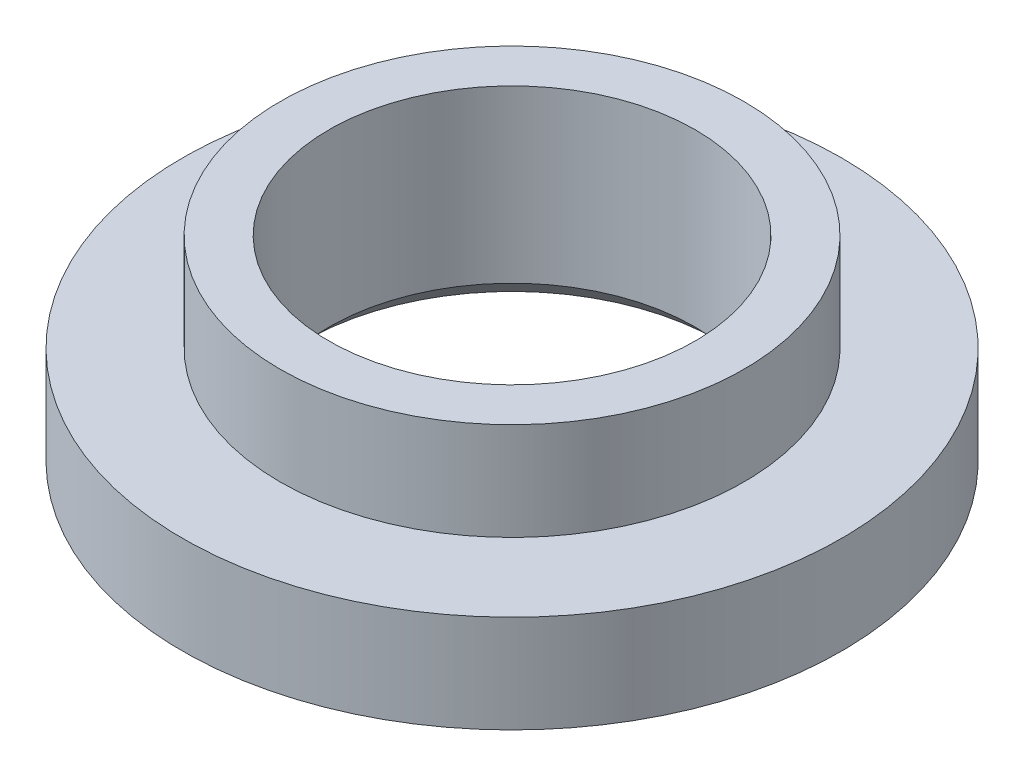
ISO-10303-21;
HEADER;
FILE_DESCRIPTION(('STEP AP214'),'2;1');
FILE_NAME('part.step','',(''),(''),'','','');
FILE_SCHEMA(('AUTOMOTIVE_DESIGN { 1 0 10303 214 1 1 1 1 }'));
ENDSEC;
DATA;
#1=APPLICATION_CONTEXT('core data for automotive mechanical design processes');
#2=APPLICATION_PROTOCOL_DEFINITION('international standard','automotive_design',2000,#1);
#3=PRODUCT_CONTEXT('',#1,'mechanical');
#4=PRODUCT('Part','Part','',(#3));
#5=PRODUCT_RELATED_PRODUCT_CATEGORY('part','',(#4));
#6=PRODUCT_DEFINITION_FORMATION('','',#4);
#7=PRODUCT_DEFINITION_CONTEXT('part definition',#1,'design');
#8=PRODUCT_DEFINITION('design','',#6,#7);
#9=PRODUCT_DEFINITION_SHAPE('','',#8);
#10=(LENGTH_UNIT() NAMED_UNIT(*) SI_UNIT(.MILLI.,.METRE.));
#11=(NAMED_UNIT(*) PLANE_ANGLE_UNIT() SI_UNIT($,.RADIAN.));
#12=(NAMED_UNIT(*) SI_UNIT($,.STERADIAN.) SOLID_ANGLE_UNIT());
#13=UNCERTAINTY_MEASURE_WITH_UNIT(LENGTH_MEASURE(1.E-05),#10,'distance_accuracy_value','');
#14=(GEOMETRIC_REPRESENTATION_CONTEXT(3) GLOBAL_UNCERTAINTY_ASSIGNED_CONTEXT((#13)) GLOBAL_UNIT_ASSIGNED_CONTEXT((#10,
#11,#12)) REPRESENTATION_CONTEXT('',''));
#15=CARTESIAN_POINT('',(0.,0.,0.));
#16=DIRECTION('',(0.,0.,1.));
#17=DIRECTION('',(1.,0.,0.));
#18=AXIS2_PLACEMENT_3D('',#15,#16,#17);
#19=CARTESIAN_POINT('',(0.,0.,0.));
#20=DIRECTION('',(0.,-1.,0.));
#21=DIRECTION('',(0.,0.,-1.));
#22=AXIS2_PLACEMENT_3D('',#19,#20,#21);
#23=CYLINDRICAL_SURFACE('',#22,1.5);
#24=CARTESIAN_POINT('',(0.,0.200000000000001,0.));
#25=DIRECTION('',(0.,-1.,0.));
#26=DIRECTION('',(0.,0.,-1.));
#27=AXIS2_PLACEMENT_3D('',#24,#25,#26);
#28=CIRCLE('',#27,1.5);
#29=CARTESIAN_POINT('',(0.,0.200000000000001,-1.5));
#30=VERTEX_POINT('',#29);
#31=EDGE_CURVE('E53',#30,#30,#28,.T.);
#32=ORIENTED_EDGE('',*,*,#31,.T.);
#33=EDGE_LOOP('',(#32));
#34=FACE_BOUND('',#33,.T.);
#35=CARTESIAN_POINT('',(0.,1.6,0.));
#36=DIRECTION('',(0.,-1.,0.));
#37=DIRECTION('',(0.,0.,-1.));
#38=AXIS2_PLACEMENT_3D('',#35,#36,#37);
#39=CIRCLE('',#38,1.5);
#40=CARTESIAN_POINT('',(0.,1.6,-1.5));
#41=VERTEX_POINT('',#40);
#42=EDGE_CURVE('E77',#41,#41,#39,.T.);
#43=ORIENTED_EDGE('',*,*,#42,.F.);
#44=EDGE_LOOP('',(#43));
#45=FACE_BOUND('',#44,.T.);
#46=ADVANCED_FACE('F44',(#34,#45),#23,.F.);
#47=CARTESIAN_POINT('',(1.5,0.,0.));
#48=DIRECTION('',(0.,-1.,0.));
#49=DIRECTION('',(0.,0.,-1.));
#50=AXIS2_PLACEMENT_3D('',#47,#48,#49);
#51=PLANE('',#50);
#52=CARTESIAN_POINT('',(0.,0.,0.));
#53=DIRECTION('',(0.,-1.,0.));
#54=DIRECTION('',(0.,0.,-1.));
#55=AXIS2_PLACEMENT_3D('',#52,#53,#54);
#56=CIRCLE('',#55,1.7);
#57=CARTESIAN_POINT('',(0.,0.,-1.7));
#58=VERTEX_POINT('',#57);
#59=EDGE_CURVE('E10',#58,#58,#56,.F.);
#60=ORIENTED_EDGE('',*,*,#59,.T.);
#61=EDGE_LOOP('',(#60));
#62=FACE_BOUND('',#61,.T.);
#63=CARTESIAN_POINT('',(0.,0.,0.));
#64=DIRECTION('',(0.,-1.,0.));
#65=DIRECTION('',(0.,0.,-1.));
#66=AXIS2_PLACEMENT_3D('',#63,#64,#65);
#67=CIRCLE('',#66,2.7);
#68=CARTESIAN_POINT('',(0.,0.,-2.7));
#69=VERTEX_POINT('',#68);
#70=EDGE_CURVE('E58',#69,#69,#67,.T.);
#71=ORIENTED_EDGE('',*,*,#70,.T.);
#72=EDGE_LOOP('',(#71));
#73=FACE_BOUND('',#72,.T.);
#74=ADVANCED_FACE('F86',(#62,#73),#51,.T.);
#75=CARTESIAN_POINT('',(0.,0.,0.));
#76=DIRECTION('',(0.,-1.,0.));
#77=DIRECTION('',(0.,0.,-1.));
#78=AXIS2_PLACEMENT_3D('',#75,#76,#77);
#79=CYLINDRICAL_SURFACE('',#78,2.7);
#80=CARTESIAN_POINT('',(0.,0.8,0.));
#81=DIRECTION('',(0.,-1.,0.));
#82=DIRECTION('',(0.,0.,-1.));
#83=AXIS2_PLACEMENT_3D('',#80,#81,#82);
#84=CIRCLE('',#83,2.7);
#85=CARTESIAN_POINT('',(0.,0.8,-2.7));
#86=VERTEX_POINT('',#85);
#87=EDGE_CURVE('E63',#86,#86,#84,.T.);
#88=ORIENTED_EDGE('',*,*,#87,.T.);
#89=EDGE_LOOP('',(#88));
#90=FACE_BOUND('',#89,.T.);
#91=ORIENTED_EDGE('',*,*,#70,.F.);
#92=EDGE_LOOP('',(#91));
#93=FACE_BOUND('',#92,.T.);
#94=ADVANCED_FACE('F91',(#90,#93),#79,.T.);
#95=CARTESIAN_POINT('',(2.7,0.8,0.));
#96=DIRECTION('',(0.,1.,0.));
#97=DIRECTION('',(0.,0.,1.));
#98=AXIS2_PLACEMENT_3D('',#95,#96,#97);
#99=PLANE('',#98);
#100=CARTESIAN_POINT('',(0.,0.799999999999999,0.));
#101=DIRECTION('',(0.,-1.,0.));
#102=DIRECTION('',(0.,0.,-1.));
#103=AXIS2_PLACEMENT_3D('',#100,#101,#102);
#104=CIRCLE('',#103,1.9);
#105=CARTESIAN_POINT('',(0.,0.799999999999999,-1.9));
#106=VERTEX_POINT('',#105);
#107=EDGE_CURVE('E69',#106,#106,#104,.T.);
#108=ORIENTED_EDGE('',*,*,#107,.T.);
#109=EDGE_LOOP('',(#108));
#110=FACE_BOUND('',#109,.T.);
#111=ORIENTED_EDGE('',*,*,#87,.F.);
#112=EDGE_LOOP('',(#111));
#113=FACE_BOUND('',#112,.T.);
#114=ADVANCED_FACE('F96',(#110,#113),#99,.T.);
#115=CARTESIAN_POINT('',(0.,0.,0.));
#116=DIRECTION('',(0.,-1.,0.));
#117=DIRECTION('',(0.,0.,-1.));
#118=AXIS2_PLACEMENT_3D('',#115,#116,#117);
#119=CYLINDRICAL_SURFACE('',#118,1.9);
#120=CARTESIAN_POINT('',(0.,1.6,0.));
#121=DIRECTION('',(0.,-1.,0.));
#122=DIRECTION('',(0.,0.,-1.));
#123=AXIS2_PLACEMENT_3D('',#120,#121,#122);
#124=CIRCLE('',#123,1.9);
#125=CARTESIAN_POINT('',(0.,1.6,-1.9));
#126=VERTEX_POINT('',#125);
#127=EDGE_CURVE('E73',#126,#126,#124,.T.);
#128=ORIENTED_EDGE('',*,*,#127,.T.);
#129=EDGE_LOOP('',(#128));
#130=FACE_BOUND('',#129,.T.);
#131=ORIENTED_EDGE('',*,*,#107,.F.);
#132=EDGE_LOOP('',(#131));
#133=FACE_BOUND('',#132,.T.);
#134=ADVANCED_FACE('F100',(#130,#133),#119,.T.);
#135=CARTESIAN_POINT('',(1.9,1.6,0.));
#136=DIRECTION('',(0.,1.,0.));
#137=DIRECTION('',(0.,0.,1.));
#138=AXIS2_PLACEMENT_3D('',#135,#136,#137);
#139=PLANE('',#138);
#140=ORIENTED_EDGE('',*,*,#42,.T.);
#141=EDGE_LOOP('',(#140));
#142=FACE_BOUND('',#141,.T.);
#143=ORIENTED_EDGE('',*,*,#127,.F.);
#144=EDGE_LOOP('',(#143));
#145=FACE_BOUND('',#144,.T.);
#146=ADVANCED_FACE('F82',(#142,#145),#139,.T.);
#147=CARTESIAN_POINT('',(0.,0.200000000000001,0.));
#148=DIRECTION('',(0.,-1.,0.));
#149=DIRECTION('',(0.,0.,-1.));
#150=AXIS2_PLACEMENT_3D('',#147,#148,#149);
#151=CONICAL_SURFACE('',#150,1.5,0.78539816339745);
#152=ORIENTED_EDGE('',*,*,#59,.F.);
#153=EDGE_LOOP('',(#152));
#154=FACE_BOUND('',#153,.T.);
#155=ORIENTED_EDGE('',*,*,#31,.F.);
#156=EDGE_LOOP('',(#155));
#157=FACE_BOUND('',#156,.T.);
#158=ADVANCED_FACE('F47',(#154,#157),#151,.F.);
#159=CLOSED_SHELL('',(#46,#74,#94,#114,#134,#146,#158));
#160=MANIFOLD_SOLID_BREP('B2',#159);
#161=ADVANCED_BREP_SHAPE_REPRESENTATION('',(#18,#160),#14);
#162=SHAPE_DEFINITION_REPRESENTATION(#9,#161);
ENDSEC;
END-ISO-10303-21;
